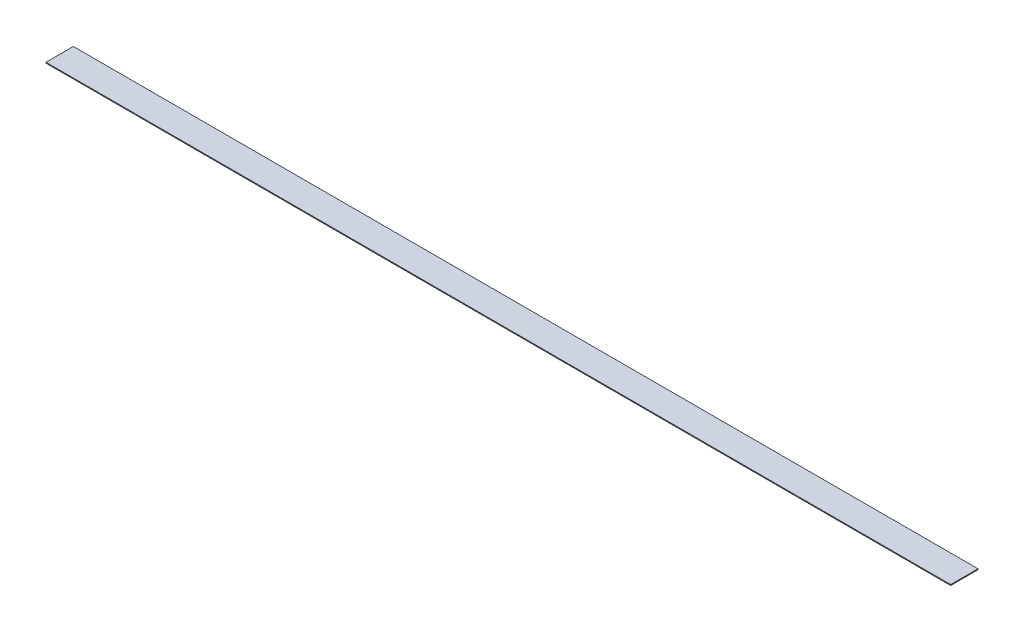
ISO-10303-21;
HEADER;
FILE_DESCRIPTION(('STEP AP214'),'2;1');
FILE_NAME('part.step','',(''),(''),'','','');
FILE_SCHEMA(('AUTOMOTIVE_DESIGN { 1 0 10303 214 1 1 1 1 }'));
ENDSEC;
DATA;
#1=APPLICATION_CONTEXT('core data for automotive mechanical design processes');
#2=APPLICATION_PROTOCOL_DEFINITION('international standard','automotive_design',2000,#1);
#3=PRODUCT_CONTEXT('',#1,'mechanical');
#4=PRODUCT('Part','Part','',(#3));
#5=PRODUCT_RELATED_PRODUCT_CATEGORY('part','',(#4));
#6=PRODUCT_DEFINITION_FORMATION('','',#4);
#7=PRODUCT_DEFINITION_CONTEXT('part definition',#1,'design');
#8=PRODUCT_DEFINITION('design','',#6,#7);
#9=PRODUCT_DEFINITION_SHAPE('','',#8);
#10=(LENGTH_UNIT() NAMED_UNIT(*) SI_UNIT(.MILLI.,.METRE.));
#11=(NAMED_UNIT(*) PLANE_ANGLE_UNIT() SI_UNIT($,.RADIAN.));
#12=(NAMED_UNIT(*) SI_UNIT($,.STERADIAN.) SOLID_ANGLE_UNIT());
#13=UNCERTAINTY_MEASURE_WITH_UNIT(LENGTH_MEASURE(1.E-05),#10,'distance_accuracy_value','');
#14=(GEOMETRIC_REPRESENTATION_CONTEXT(3) GLOBAL_UNCERTAINTY_ASSIGNED_CONTEXT((#13)) GLOBAL_UNIT_ASSIGNED_CONTEXT((#10,
#11,#12)) REPRESENTATION_CONTEXT('',''));
#15=CARTESIAN_POINT('',(0.,0.,0.));
#16=DIRECTION('',(0.,0.,1.));
#17=DIRECTION('',(1.,0.,0.));
#18=AXIS2_PLACEMENT_3D('',#15,#16,#17);
#19=CARTESIAN_POINT('',(0.,1.5875,0.));
#20=DIRECTION('',(1.,0.,0.));
#21=DIRECTION('',(0.,0.,-1.));
#22=AXIS2_PLACEMENT_3D('',#19,#20,#21);
#23=PLANE('',#22);
#24=DIRECTION('',(0.,0.,1.));
#25=VECTOR('',#24,1.);
#26=CARTESIAN_POINT('',(0.,0.,0.));
#27=LINE('',#26,#25);
#28=CARTESIAN_POINT('',(0.,0.,-50.8));
#29=VERTEX_POINT('',#28);
#30=CARTESIAN_POINT('',(0.,0.,0.));
#31=VERTEX_POINT('',#30);
#32=EDGE_CURVE('E98',#29,#31,#27,.T.);
#33=ORIENTED_EDGE('',*,*,#32,.T.);
#34=DIRECTION('',(0.,-1.,0.));
#35=VECTOR('',#34,1.);
#36=CARTESIAN_POINT('',(0.,1.5875,0.));
#37=LINE('',#36,#35);
#38=CARTESIAN_POINT('',(0.,1.5875,0.));
#39=VERTEX_POINT('',#38);
#40=EDGE_CURVE('E11',#39,#31,#37,.T.);
#41=ORIENTED_EDGE('',*,*,#40,.F.);
#42=DIRECTION('',(0.,0.,1.));
#43=VECTOR('',#42,1.);
#44=CARTESIAN_POINT('',(0.,1.5875,0.));
#45=LINE('',#44,#43);
#46=CARTESIAN_POINT('',(0.,1.5875,-50.8));
#47=VERTEX_POINT('',#46);
#48=EDGE_CURVE('E86',#47,#39,#45,.T.);
#49=ORIENTED_EDGE('',*,*,#48,.F.);
#50=DIRECTION('',(0.,-1.,0.));
#51=VECTOR('',#50,1.);
#52=CARTESIAN_POINT('',(0.,1.5875,-50.8));
#53=LINE('',#52,#51);
#54=EDGE_CURVE('E94',#47,#29,#53,.T.);
#55=ORIENTED_EDGE('',*,*,#54,.T.);
#56=EDGE_LOOP('',(#33,#41,#49,#55));
#57=FACE_BOUND('',#56,.T.);
#58=ADVANCED_FACE('F35',(#57),#23,.F.);
#59=CARTESIAN_POINT('',(0.,1.5875,0.));
#60=DIRECTION('',(0.,0.,-1.));
#61=DIRECTION('',(-1.,0.,0.));
#62=AXIS2_PLACEMENT_3D('',#59,#60,#61);
#63=PLANE('',#62);
#64=DIRECTION('',(1.,0.,0.));
#65=VECTOR('',#64,1.);
#66=CARTESIAN_POINT('',(0.,0.,0.));
#67=LINE('',#66,#65);
#68=CARTESIAN_POINT('',(1682.75,0.,0.));
#69=VERTEX_POINT('',#68);
#70=EDGE_CURVE('E90',#31,#69,#67,.T.);
#71=ORIENTED_EDGE('',*,*,#70,.T.);
#72=DIRECTION('',(0.,-1.,0.));
#73=VECTOR('',#72,1.);
#74=CARTESIAN_POINT('',(1682.75,1.5875,0.));
#75=LINE('',#74,#73);
#76=CARTESIAN_POINT('',(1682.75,1.5875,0.));
#77=VERTEX_POINT('',#76);
#78=EDGE_CURVE('E43',#77,#69,#75,.T.);
#79=ORIENTED_EDGE('',*,*,#78,.F.);
#80=DIRECTION('',(1.,0.,0.));
#81=VECTOR('',#80,1.);
#82=CARTESIAN_POINT('',(0.,1.5875,0.));
#83=LINE('',#82,#81);
#84=EDGE_CURVE('E81',#39,#77,#83,.T.);
#85=ORIENTED_EDGE('',*,*,#84,.F.);
#86=ORIENTED_EDGE('',*,*,#40,.T.);
#87=EDGE_LOOP('',(#71,#79,#85,#86));
#88=FACE_BOUND('',#87,.T.);
#89=ADVANCED_FACE('F89',(#88),#63,.F.);
#90=CARTESIAN_POINT('',(1682.75,1.5875,0.));
#91=DIRECTION('',(-1.,0.,0.));
#92=DIRECTION('',(0.,0.,1.));
#93=AXIS2_PLACEMENT_3D('',#90,#91,#92);
#94=PLANE('',#93);
#95=DIRECTION('',(0.,0.,-1.));
#96=VECTOR('',#95,1.);
#97=CARTESIAN_POINT('',(1682.75,0.,0.));
#98=LINE('',#97,#96);
#99=CARTESIAN_POINT('',(1682.75,0.,-50.8));
#100=VERTEX_POINT('',#99);
#101=EDGE_CURVE('E68',#69,#100,#98,.T.);
#102=ORIENTED_EDGE('',*,*,#101,.T.);
#103=DIRECTION('',(0.,-1.,0.));
#104=VECTOR('',#103,1.);
#105=CARTESIAN_POINT('',(1682.75,1.5875,-50.8));
#106=LINE('',#105,#104);
#107=CARTESIAN_POINT('',(1682.75,1.5875,-50.8));
#108=VERTEX_POINT('',#107);
#109=EDGE_CURVE('E91',#108,#100,#106,.T.);
#110=ORIENTED_EDGE('',*,*,#109,.F.);
#111=DIRECTION('',(0.,0.,-1.));
#112=VECTOR('',#111,1.);
#113=CARTESIAN_POINT('',(1682.75,1.5875,0.));
#114=LINE('',#113,#112);
#115=EDGE_CURVE('E84',#77,#108,#114,.T.);
#116=ORIENTED_EDGE('',*,*,#115,.F.);
#117=ORIENTED_EDGE('',*,*,#78,.T.);
#118=EDGE_LOOP('',(#102,#110,#116,#117));
#119=FACE_BOUND('',#118,.T.);
#120=ADVANCED_FACE('F92',(#119),#94,.F.);
#121=CARTESIAN_POINT('',(0.,1.5875,-50.8));
#122=DIRECTION('',(0.,0.,1.));
#123=DIRECTION('',(1.,0.,0.));
#124=AXIS2_PLACEMENT_3D('',#121,#122,#123);
#125=PLANE('',#124);
#126=DIRECTION('',(-1.,0.,0.));
#127=VECTOR('',#126,1.);
#128=CARTESIAN_POINT('',(0.,0.,-50.8));
#129=LINE('',#128,#127);
#130=EDGE_CURVE('E74',#100,#29,#129,.T.);
#131=ORIENTED_EDGE('',*,*,#130,.T.);
#132=ORIENTED_EDGE('',*,*,#54,.F.);
#133=DIRECTION('',(-1.,0.,0.));
#134=VECTOR('',#133,1.);
#135=CARTESIAN_POINT('',(0.,1.5875,-50.8));
#136=LINE('',#135,#134);
#137=EDGE_CURVE('E51',#108,#47,#136,.T.);
#138=ORIENTED_EDGE('',*,*,#137,.F.);
#139=ORIENTED_EDGE('',*,*,#109,.T.);
#140=EDGE_LOOP('',(#131,#132,#138,#139));
#141=FACE_BOUND('',#140,.T.);
#142=ADVANCED_FACE('F105',(#141),#125,.F.);
#143=CARTESIAN_POINT('',(0.,1.5875,0.));
#144=DIRECTION('',(0.,-1.,0.));
#145=DIRECTION('',(0.,0.,-1.));
#146=AXIS2_PLACEMENT_3D('',#143,#144,#145);
#147=PLANE('',#146);
#148=ORIENTED_EDGE('',*,*,#48,.T.);
#149=ORIENTED_EDGE('',*,*,#84,.T.);
#150=ORIENTED_EDGE('',*,*,#115,.T.);
#151=ORIENTED_EDGE('',*,*,#137,.T.);
#152=EDGE_LOOP('',(#148,#149,#150,#151));
#153=FACE_BOUND('',#152,.T.);
#154=ADVANCED_FACE('F82',(#153),#147,.F.);
#155=CARTESIAN_POINT('',(0.,0.,0.));
#156=DIRECTION('',(0.,-1.,0.));
#157=DIRECTION('',(0.,0.,-1.));
#158=AXIS2_PLACEMENT_3D('',#155,#156,#157);
#159=PLANE('',#158);
#160=ORIENTED_EDGE('',*,*,#32,.F.);
#161=ORIENTED_EDGE('',*,*,#130,.F.);
#162=ORIENTED_EDGE('',*,*,#101,.F.);
#163=ORIENTED_EDGE('',*,*,#70,.F.);
#164=EDGE_LOOP('',(#160,#161,#162,#163));
#165=FACE_BOUND('',#164,.T.);
#166=ADVANCED_FACE('F108',(#165),#159,.T.);
#167=CLOSED_SHELL('',(#58,#89,#120,#142,#154,#166));
#168=MANIFOLD_SOLID_BREP('B2',#167);
#169=ADVANCED_BREP_SHAPE_REPRESENTATION('',(#18,#168),#14);
#170=SHAPE_DEFINITION_REPRESENTATION(#9,#169);
ENDSEC;
END-ISO-10303-21;
